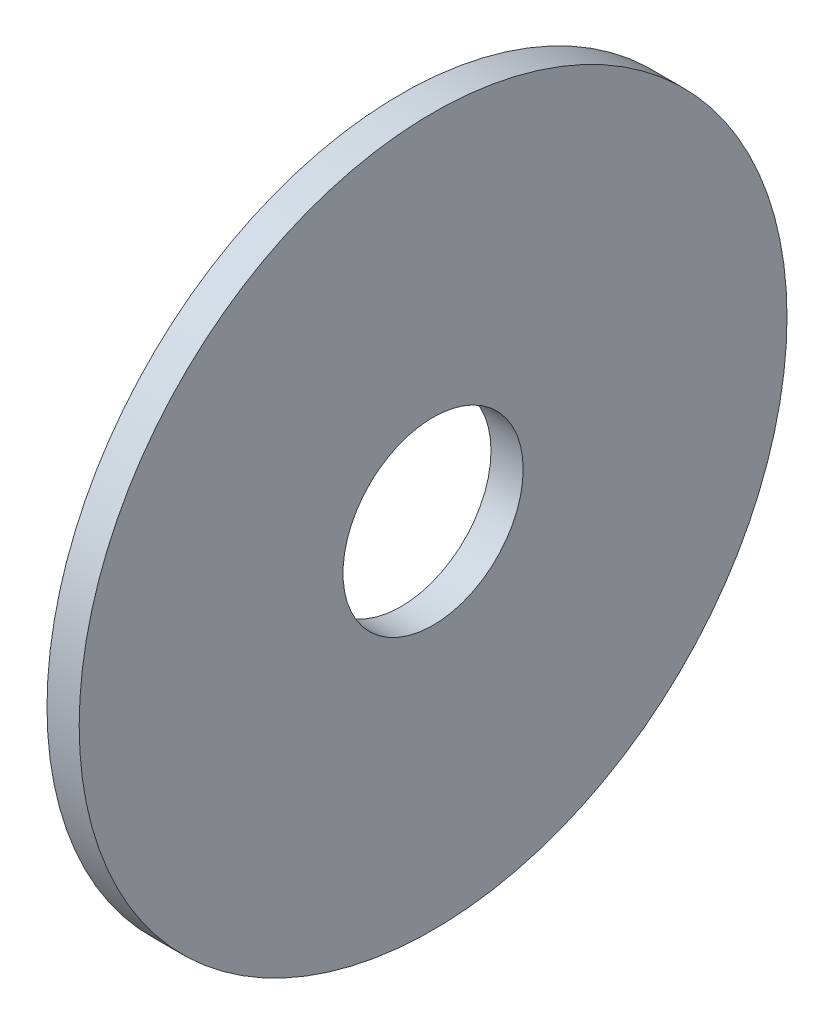
ISO-10303-21;
HEADER;
FILE_DESCRIPTION(('STEP AP214'),'2;1');
FILE_NAME('part.step','',(''),(''),'','','');
FILE_SCHEMA(('AUTOMOTIVE_DESIGN { 1 0 10303 214 1 1 1 1 }'));
ENDSEC;
DATA;
#1=APPLICATION_CONTEXT('core data for automotive mechanical design processes');
#2=APPLICATION_PROTOCOL_DEFINITION('international standard','automotive_design',2000,#1);
#3=PRODUCT_CONTEXT('',#1,'mechanical');
#4=PRODUCT('Part','Part','',(#3));
#5=PRODUCT_RELATED_PRODUCT_CATEGORY('part','',(#4));
#6=PRODUCT_DEFINITION_FORMATION('','',#4);
#7=PRODUCT_DEFINITION_CONTEXT('part definition',#1,'design');
#8=PRODUCT_DEFINITION('design','',#6,#7);
#9=PRODUCT_DEFINITION_SHAPE('','',#8);
#10=(LENGTH_UNIT() NAMED_UNIT(*) SI_UNIT(.MILLI.,.METRE.));
#11=(NAMED_UNIT(*) PLANE_ANGLE_UNIT() SI_UNIT($,.RADIAN.));
#12=(NAMED_UNIT(*) SI_UNIT($,.STERADIAN.) SOLID_ANGLE_UNIT());
#13=UNCERTAINTY_MEASURE_WITH_UNIT(LENGTH_MEASURE(1.E-05),#10,'distance_accuracy_value','');
#14=(GEOMETRIC_REPRESENTATION_CONTEXT(3) GLOBAL_UNCERTAINTY_ASSIGNED_CONTEXT((#13)) GLOBAL_UNIT_ASSIGNED_CONTEXT((#10,
#11,#12)) REPRESENTATION_CONTEXT('',''));
#15=CARTESIAN_POINT('',(0.,0.,0.));
#16=DIRECTION('',(0.,0.,1.));
#17=DIRECTION('',(1.,0.,0.));
#18=AXIS2_PLACEMENT_3D('',#15,#16,#17);
#19=CARTESIAN_POINT('',(5.,0.,0.));
#20=DIRECTION('',(1.,0.,0.));
#21=DIRECTION('',(0.,0.,-1.));
#22=AXIS2_PLACEMENT_3D('',#19,#20,#21);
#23=PLANE('',#22);
#24=CARTESIAN_POINT('',(5.,0.,0.));
#25=DIRECTION('',(1.,0.,0.));
#26=DIRECTION('',(0.,0.,-1.));
#27=AXIS2_PLACEMENT_3D('',#24,#25,#26);
#28=CIRCLE('',#27,55.);
#29=CARTESIAN_POINT('',(5.,0.,-55.));
#30=VERTEX_POINT('',#29);
#31=EDGE_CURVE('E10',#30,#30,#28,.T.);
#32=ORIENTED_EDGE('',*,*,#31,.T.);
#33=EDGE_LOOP('',(#32));
#34=FACE_BOUND('',#33,.T.);
#35=CARTESIAN_POINT('',(5.,0.,0.));
#36=DIRECTION('',(1.,0.,0.));
#37=DIRECTION('',(0.,0.,-1.));
#38=AXIS2_PLACEMENT_3D('',#35,#36,#37);
#39=CIRCLE('',#38,14.);
#40=CARTESIAN_POINT('',(5.,0.,-14.));
#41=VERTEX_POINT('',#40);
#42=EDGE_CURVE('E44',#41,#41,#39,.T.);
#43=ORIENTED_EDGE('',*,*,#42,.F.);
#44=EDGE_LOOP('',(#43));
#45=FACE_BOUND('',#44,.T.);
#46=ADVANCED_FACE('F33',(#34,#45),#23,.T.);
#47=CARTESIAN_POINT('',(0.,0.,0.));
#48=DIRECTION('',(1.,0.,0.));
#49=DIRECTION('',(0.,0.,-1.));
#50=AXIS2_PLACEMENT_3D('',#47,#48,#49);
#51=PLANE('',#50);
#52=CARTESIAN_POINT('',(0.,0.,0.));
#53=DIRECTION('',(1.,0.,0.));
#54=DIRECTION('',(0.,0.,-1.));
#55=AXIS2_PLACEMENT_3D('',#52,#53,#54);
#56=CIRCLE('',#55,55.);
#57=CARTESIAN_POINT('',(0.,0.,-55.));
#58=VERTEX_POINT('',#57);
#59=EDGE_CURVE('E37',#58,#58,#56,.T.);
#60=ORIENTED_EDGE('',*,*,#59,.F.);
#61=EDGE_LOOP('',(#60));
#62=FACE_BOUND('',#61,.T.);
#63=CARTESIAN_POINT('',(0.,0.,0.));
#64=DIRECTION('',(1.,0.,0.));
#65=DIRECTION('',(0.,0.,-1.));
#66=AXIS2_PLACEMENT_3D('',#63,#64,#65);
#67=CIRCLE('',#66,14.);
#68=CARTESIAN_POINT('',(0.,0.,-14.));
#69=VERTEX_POINT('',#68);
#70=EDGE_CURVE('E46',#69,#69,#67,.T.);
#71=ORIENTED_EDGE('',*,*,#70,.T.);
#72=EDGE_LOOP('',(#71));
#73=FACE_BOUND('',#72,.T.);
#74=ADVANCED_FACE('F56',(#62,#73),#51,.F.);
#75=CARTESIAN_POINT('',(5.,0.,0.));
#76=DIRECTION('',(-1.,0.,0.));
#77=DIRECTION('',(0.,0.,1.));
#78=AXIS2_PLACEMENT_3D('',#75,#76,#77);
#79=CYLINDRICAL_SURFACE('',#78,55.);
#80=ORIENTED_EDGE('',*,*,#31,.F.);
#81=EDGE_LOOP('',(#80));
#82=FACE_BOUND('',#81,.T.);
#83=ORIENTED_EDGE('',*,*,#59,.T.);
#84=EDGE_LOOP('',(#83));
#85=FACE_BOUND('',#84,.T.);
#86=ADVANCED_FACE('F35',(#82,#85),#79,.T.);
#87=CARTESIAN_POINT('',(5.,0.,0.));
#88=DIRECTION('',(-1.,0.,0.));
#89=DIRECTION('',(0.,0.,1.));
#90=AXIS2_PLACEMENT_3D('',#87,#88,#89);
#91=CYLINDRICAL_SURFACE('',#90,14.);
#92=ORIENTED_EDGE('',*,*,#42,.T.);
#93=EDGE_LOOP('',(#92));
#94=FACE_BOUND('',#93,.T.);
#95=ORIENTED_EDGE('',*,*,#70,.F.);
#96=EDGE_LOOP('',(#95));
#97=FACE_BOUND('',#96,.T.);
#98=ADVANCED_FACE('F52',(#94,#97),#91,.F.);
#99=CLOSED_SHELL('',(#46,#74,#86,#98));
#100=MANIFOLD_SOLID_BREP('B2',#99);
#101=ADVANCED_BREP_SHAPE_REPRESENTATION('',(#18,#100),#14);
#102=SHAPE_DEFINITION_REPRESENTATION(#9,#101);
ENDSEC;
END-ISO-10303-21;
